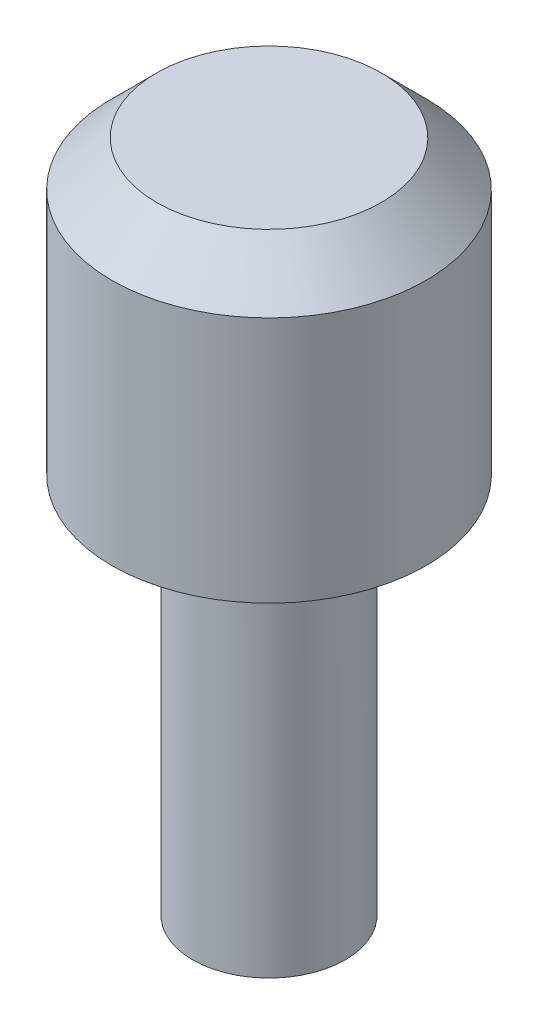
ISO-10303-21;
HEADER;
FILE_DESCRIPTION(('STEP AP214'),'2;1');
FILE_NAME('part.step','',(''),(''),'','','');
FILE_SCHEMA(('AUTOMOTIVE_DESIGN { 1 0 10303 214 1 1 1 1 }'));
ENDSEC;
DATA;
#1=APPLICATION_CONTEXT('core data for automotive mechanical design processes');
#2=APPLICATION_PROTOCOL_DEFINITION('international standard','automotive_design',2000,#1);
#3=PRODUCT_CONTEXT('',#1,'mechanical');
#4=PRODUCT('Part','Part','',(#3));
#5=PRODUCT_RELATED_PRODUCT_CATEGORY('part','',(#4));
#6=PRODUCT_DEFINITION_FORMATION('','',#4);
#7=PRODUCT_DEFINITION_CONTEXT('part definition',#1,'design');
#8=PRODUCT_DEFINITION('design','',#6,#7);
#9=PRODUCT_DEFINITION_SHAPE('','',#8);
#10=(LENGTH_UNIT() NAMED_UNIT(*) SI_UNIT(.MILLI.,.METRE.));
#11=(NAMED_UNIT(*) PLANE_ANGLE_UNIT() SI_UNIT($,.RADIAN.));
#12=(NAMED_UNIT(*) SI_UNIT($,.STERADIAN.) SOLID_ANGLE_UNIT());
#13=UNCERTAINTY_MEASURE_WITH_UNIT(LENGTH_MEASURE(1.E-05),#10,'distance_accuracy_value','');
#14=(GEOMETRIC_REPRESENTATION_CONTEXT(3) GLOBAL_UNCERTAINTY_ASSIGNED_CONTEXT((#13)) GLOBAL_UNIT_ASSIGNED_CONTEXT((#10,
#11,#12)) REPRESENTATION_CONTEXT('',''));
#15=CARTESIAN_POINT('',(0.,0.,0.));
#16=DIRECTION('',(0.,0.,1.));
#17=DIRECTION('',(1.,0.,0.));
#18=AXIS2_PLACEMENT_3D('',#15,#16,#17);
#19=CARTESIAN_POINT('',(0.,0.,0.));
#20=DIRECTION('',(0.,1.,0.));
#21=DIRECTION('',(0.,0.,1.));
#22=AXIS2_PLACEMENT_3D('',#19,#20,#21);
#23=PLANE('',#22);
#24=CARTESIAN_POINT('',(0.,0.,0.));
#25=DIRECTION('',(0.,1.,0.));
#26=DIRECTION('',(0.,0.,1.));
#27=AXIS2_PLACEMENT_3D('',#24,#25,#26);
#28=CIRCLE('',#27,3.5);
#29=CARTESIAN_POINT('',(0.,0.,3.5));
#30=VERTEX_POINT('',#29);
#31=EDGE_CURVE('E45',#30,#30,#28,.T.);
#32=ORIENTED_EDGE('',*,*,#31,.F.);
#33=EDGE_LOOP('',(#32));
#34=FACE_BOUND('',#33,.T.);
#35=CARTESIAN_POINT('',(0.,0.,0.));
#36=DIRECTION('',(0.,1.,0.));
#37=DIRECTION('',(0.,0.,1.));
#38=AXIS2_PLACEMENT_3D('',#35,#36,#37);
#39=CIRCLE('',#38,1.7);
#40=CARTESIAN_POINT('',(0.,0.,1.7));
#41=VERTEX_POINT('',#40);
#42=EDGE_CURVE('E10',#41,#41,#39,.F.);
#43=ORIENTED_EDGE('',*,*,#42,.F.);
#44=EDGE_LOOP('',(#43));
#45=FACE_BOUND('',#44,.T.);
#46=ADVANCED_FACE('F30',(#34,#45),#23,.F.);
#47=CARTESIAN_POINT('',(0.,6.5,0.));
#48=DIRECTION('',(0.,-1.,0.));
#49=DIRECTION('',(0.,0.,-1.));
#50=AXIS2_PLACEMENT_3D('',#47,#48,#49);
#51=CYLINDRICAL_SURFACE('',#50,3.5);
#52=CARTESIAN_POINT('',(0.,5.5,0.));
#53=DIRECTION('',(0.,1.,0.));
#54=DIRECTION('',(0.,0.,1.));
#55=AXIS2_PLACEMENT_3D('',#52,#53,#54);
#56=CIRCLE('',#55,3.5);
#57=CARTESIAN_POINT('',(0.,5.5,3.5));
#58=VERTEX_POINT('',#57);
#59=EDGE_CURVE('E37',#58,#58,#56,.F.);
#60=ORIENTED_EDGE('',*,*,#59,.T.);
#61=EDGE_LOOP('',(#60));
#62=FACE_BOUND('',#61,.T.);
#63=ORIENTED_EDGE('',*,*,#31,.T.);
#64=EDGE_LOOP('',(#63));
#65=FACE_BOUND('',#64,.T.);
#66=ADVANCED_FACE('F68',(#62,#65),#51,.T.);
#67=CARTESIAN_POINT('',(0.,6.5,0.));
#68=DIRECTION('',(0.,1.,0.));
#69=DIRECTION('',(0.,0.,1.));
#70=AXIS2_PLACEMENT_3D('',#67,#68,#69);
#71=PLANE('',#70);
#72=CARTESIAN_POINT('',(0.,6.5,0.));
#73=DIRECTION('',(0.,1.,0.));
#74=DIRECTION('',(0.,0.,1.));
#75=AXIS2_PLACEMENT_3D('',#72,#73,#74);
#76=CIRCLE('',#75,2.50000000000001);
#77=CARTESIAN_POINT('',(0.,6.5,2.50000000000001));
#78=VERTEX_POINT('',#77);
#79=EDGE_CURVE('E41',#78,#78,#76,.T.);
#80=ORIENTED_EDGE('',*,*,#79,.T.);
#81=EDGE_LOOP('',(#80));
#82=FACE_BOUND('',#81,.T.);
#83=ADVANCED_FACE('F64',(#82),#71,.T.);
#84=CARTESIAN_POINT('',(0.,6.5,0.));
#85=DIRECTION('',(0.,-1.,0.));
#86=DIRECTION('',(0.,0.,-1.));
#87=AXIS2_PLACEMENT_3D('',#84,#85,#86);
#88=CONICAL_SURFACE('',#87,2.50000000000001,0.785398163397446);
#89=ORIENTED_EDGE('',*,*,#59,.F.);
#90=EDGE_LOOP('',(#89));
#91=FACE_BOUND('',#90,.T.);
#92=ORIENTED_EDGE('',*,*,#79,.F.);
#93=EDGE_LOOP('',(#92));
#94=FACE_BOUND('',#93,.T.);
#95=ADVANCED_FACE('F32',(#91,#94),#88,.T.);
#96=CARTESIAN_POINT('',(0.,-8.5,0.));
#97=DIRECTION('',(0.,1.,0.));
#98=DIRECTION('',(0.,0.,1.));
#99=AXIS2_PLACEMENT_3D('',#96,#97,#98);
#100=CYLINDRICAL_SURFACE('',#99,1.7);
#101=CARTESIAN_POINT('',(0.,-8.5,0.));
#102=DIRECTION('',(0.,-1.,0.));
#103=DIRECTION('',(0.,0.,-1.));
#104=AXIS2_PLACEMENT_3D('',#101,#102,#103);
#105=CIRCLE('',#104,1.7);
#106=CARTESIAN_POINT('',(0.,-8.5,-1.7));
#107=VERTEX_POINT('',#106);
#108=EDGE_CURVE('E50',#107,#107,#105,.T.);
#109=ORIENTED_EDGE('',*,*,#108,.F.);
#110=EDGE_LOOP('',(#109));
#111=FACE_BOUND('',#110,.T.);
#112=ORIENTED_EDGE('',*,*,#42,.T.);
#113=EDGE_LOOP('',(#112));
#114=FACE_BOUND('',#113,.T.);
#115=ADVANCED_FACE('F56',(#111,#114),#100,.T.);
#116=CARTESIAN_POINT('',(0.,-8.5,0.));
#117=DIRECTION('',(0.,-1.,0.));
#118=DIRECTION('',(0.,0.,-1.));
#119=AXIS2_PLACEMENT_3D('',#116,#117,#118);
#120=PLANE('',#119);
#121=ORIENTED_EDGE('',*,*,#108,.T.);
#122=EDGE_LOOP('',(#121));
#123=FACE_BOUND('',#122,.T.);
#124=ADVANCED_FACE('F54',(#123),#120,.T.);
#125=CLOSED_SHELL('',(#46,#66,#83,#95,#115,#124));
#126=MANIFOLD_SOLID_BREP('B2',#125);
#127=ADVANCED_BREP_SHAPE_REPRESENTATION('',(#18,#126),#14);
#128=SHAPE_DEFINITION_REPRESENTATION(#9,#127);
ENDSEC;
END-ISO-10303-21;
